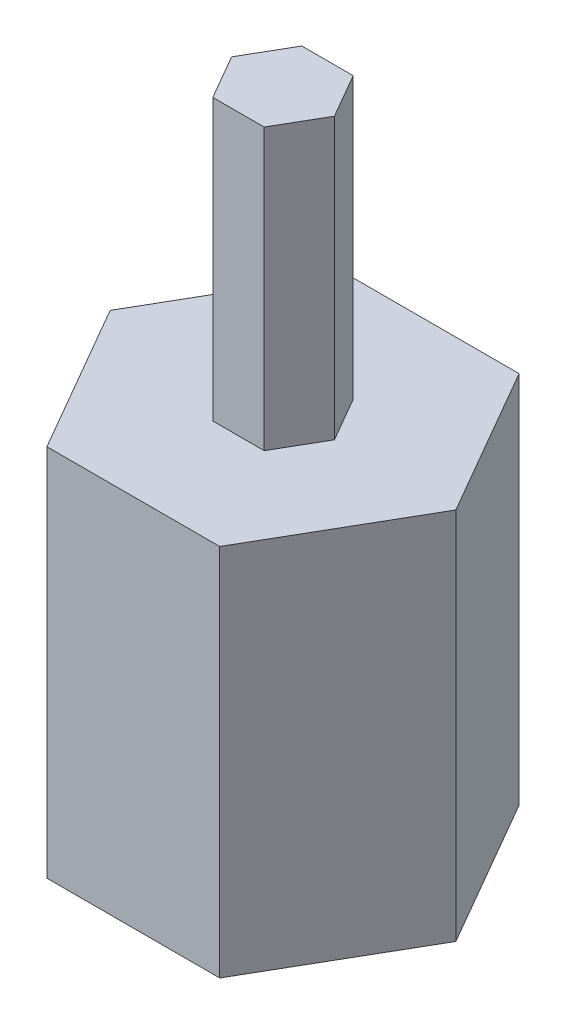
ISO-10303-21;
HEADER;
FILE_DESCRIPTION(('STEP AP214'),'2;1');
FILE_NAME('part.step','',(''),(''),'','','');
FILE_SCHEMA(('AUTOMOTIVE_DESIGN { 1 0 10303 214 1 1 1 1 }'));
ENDSEC;
DATA;
#1=APPLICATION_CONTEXT('core data for automotive mechanical design processes');
#2=APPLICATION_PROTOCOL_DEFINITION('international standard','automotive_design',2000,#1);
#3=PRODUCT_CONTEXT('',#1,'mechanical');
#4=PRODUCT('Part','Part','',(#3));
#5=PRODUCT_RELATED_PRODUCT_CATEGORY('part','',(#4));
#6=PRODUCT_DEFINITION_FORMATION('','',#4);
#7=PRODUCT_DEFINITION_CONTEXT('part definition',#1,'design');
#8=PRODUCT_DEFINITION('design','',#6,#7);
#9=PRODUCT_DEFINITION_SHAPE('','',#8);
#10=(LENGTH_UNIT() NAMED_UNIT(*) SI_UNIT(.MILLI.,.METRE.));
#11=(NAMED_UNIT(*) PLANE_ANGLE_UNIT() SI_UNIT($,.RADIAN.));
#12=(NAMED_UNIT(*) SI_UNIT($,.STERADIAN.) SOLID_ANGLE_UNIT());
#13=UNCERTAINTY_MEASURE_WITH_UNIT(LENGTH_MEASURE(1.E-05),#10,'distance_accuracy_value','');
#14=(GEOMETRIC_REPRESENTATION_CONTEXT(3) GLOBAL_UNCERTAINTY_ASSIGNED_CONTEXT((#13)) GLOBAL_UNIT_ASSIGNED_CONTEXT((#10,
#11,#12)) REPRESENTATION_CONTEXT('',''));
#15=CARTESIAN_POINT('',(0.,0.,0.));
#16=DIRECTION('',(0.,0.,1.));
#17=DIRECTION('',(1.,0.,0.));
#18=AXIS2_PLACEMENT_3D('',#15,#16,#17);
#19=CARTESIAN_POINT('',(0.549999999999999,6.,0.952627944162883));
#20=DIRECTION('',(-0.866025403784439,0.,-0.5));
#21=DIRECTION('',(-0.5,0.,0.866025403784439));
#22=AXIS2_PLACEMENT_3D('',#19,#20,#21);
#23=PLANE('',#22);
#24=DIRECTION('',(0.5,0.,-0.866025403784439));
#25=VECTOR('',#24,1.);
#26=CARTESIAN_POINT('',(0.549999999999999,0.,0.952627944162883));
#27=LINE('',#26,#25);
#28=CARTESIAN_POINT('',(0.549999999999999,0.,0.952627944162883));
#29=VERTEX_POINT('',#28);
#30=CARTESIAN_POINT('',(1.1,0.,0.));
#31=VERTEX_POINT('',#30);
#32=EDGE_CURVE('E145',#29,#31,#27,.T.);
#33=ORIENTED_EDGE('',*,*,#32,.T.);
#34=DIRECTION('',(0.,-1.,0.));
#35=VECTOR('',#34,1.);
#36=CARTESIAN_POINT('',(1.1,6.,0.));
#37=LINE('',#36,#35);
#38=CARTESIAN_POINT('',(1.1,6.,0.));
#39=VERTEX_POINT('',#38);
#40=EDGE_CURVE('E11',#39,#31,#37,.T.);
#41=ORIENTED_EDGE('',*,*,#40,.F.);
#42=DIRECTION('',(0.5,0.,-0.866025403784439));
#43=VECTOR('',#42,1.);
#44=CARTESIAN_POINT('',(0.549999999999999,6.,0.952627944162883));
#45=LINE('',#44,#43);
#46=CARTESIAN_POINT('',(0.549999999999999,6.,0.952627944162883));
#47=VERTEX_POINT('',#46);
#48=EDGE_CURVE('E154',#47,#39,#45,.T.);
#49=ORIENTED_EDGE('',*,*,#48,.F.);
#50=DIRECTION('',(0.,-1.,0.));
#51=VECTOR('',#50,1.);
#52=CARTESIAN_POINT('',(0.549999999999999,6.,0.952627944162883));
#53=LINE('',#52,#51);
#54=EDGE_CURVE('E165',#47,#29,#53,.T.);
#55=ORIENTED_EDGE('',*,*,#54,.T.);
#56=EDGE_LOOP('',(#33,#41,#49,#55));
#57=FACE_BOUND('',#56,.T.);
#58=ADVANCED_FACE('F36',(#57),#23,.F.);
#59=CARTESIAN_POINT('',(1.1,6.,0.));
#60=DIRECTION('',(-0.866025403784439,0.,0.5));
#61=DIRECTION('',(0.5,0.,0.866025403784439));
#62=AXIS2_PLACEMENT_3D('',#59,#60,#61);
#63=PLANE('',#62);
#64=DIRECTION('',(-0.5,0.,-0.866025403784439));
#65=VECTOR('',#64,1.);
#66=CARTESIAN_POINT('',(1.1,0.,0.));
#67=LINE('',#66,#65);
#68=CARTESIAN_POINT('',(0.55,0.,-0.952627944162883));
#69=VERTEX_POINT('',#68);
#70=EDGE_CURVE('E148',#31,#69,#67,.T.);
#71=ORIENTED_EDGE('',*,*,#70,.T.);
#72=DIRECTION('',(0.,-1.,0.));
#73=VECTOR('',#72,1.);
#74=CARTESIAN_POINT('',(0.55,6.,-0.952627944162883));
#75=LINE('',#74,#73);
#76=CARTESIAN_POINT('',(0.55,6.,-0.952627944162883));
#77=VERTEX_POINT('',#76);
#78=EDGE_CURVE('E44',#77,#69,#75,.T.);
#79=ORIENTED_EDGE('',*,*,#78,.F.);
#80=DIRECTION('',(-0.5,0.,-0.866025403784439));
#81=VECTOR('',#80,1.);
#82=CARTESIAN_POINT('',(1.1,6.,0.));
#83=LINE('',#82,#81);
#84=EDGE_CURVE('E156',#39,#77,#83,.T.);
#85=ORIENTED_EDGE('',*,*,#84,.F.);
#86=ORIENTED_EDGE('',*,*,#40,.T.);
#87=EDGE_LOOP('',(#71,#79,#85,#86));
#88=FACE_BOUND('',#87,.T.);
#89=ADVANCED_FACE('F198',(#88),#63,.F.);
#90=CARTESIAN_POINT('',(0.55,6.,-0.952627944162883));
#91=DIRECTION('',(0.,0.,1.));
#92=DIRECTION('',(1.,0.,0.));
#93=AXIS2_PLACEMENT_3D('',#90,#91,#92);
#94=PLANE('',#93);
#95=DIRECTION('',(-1.,0.,0.));
#96=VECTOR('',#95,1.);
#97=CARTESIAN_POINT('',(0.55,0.,-0.952627944162883));
#98=LINE('',#97,#96);
#99=CARTESIAN_POINT('',(-0.549999999999999,0.,-0.952627944162883));
#100=VERTEX_POINT('',#99);
#101=EDGE_CURVE('E169',#69,#100,#98,.T.);
#102=ORIENTED_EDGE('',*,*,#101,.T.);
#103=DIRECTION('',(0.,-1.,0.));
#104=VECTOR('',#103,1.);
#105=CARTESIAN_POINT('',(-0.549999999999999,6.,-0.952627944162883));
#106=LINE('',#105,#104);
#107=CARTESIAN_POINT('',(-0.549999999999999,6.,-0.952627944162883));
#108=VERTEX_POINT('',#107);
#109=EDGE_CURVE('E188',#108,#100,#106,.T.);
#110=ORIENTED_EDGE('',*,*,#109,.F.);
#111=DIRECTION('',(-1.,0.,0.));
#112=VECTOR('',#111,1.);
#113=CARTESIAN_POINT('',(0.55,6.,-0.952627944162883));
#114=LINE('',#113,#112);
#115=EDGE_CURVE('E159',#77,#108,#114,.T.);
#116=ORIENTED_EDGE('',*,*,#115,.F.);
#117=ORIENTED_EDGE('',*,*,#78,.T.);
#118=EDGE_LOOP('',(#102,#110,#116,#117));
#119=FACE_BOUND('',#118,.T.);
#120=ADVANCED_FACE('F194',(#119),#94,.F.);
#121=CARTESIAN_POINT('',(-0.549999999999999,6.,-0.952627944162883));
#122=DIRECTION('',(0.866025403784438,0.,0.5));
#123=DIRECTION('',(0.5,0.,-0.866025403784439));
#124=AXIS2_PLACEMENT_3D('',#121,#122,#123);
#125=PLANE('',#124);
#126=DIRECTION('',(-0.5,0.,0.866025403784439));
#127=VECTOR('',#126,1.);
#128=CARTESIAN_POINT('',(-0.549999999999999,0.,-0.952627944162883));
#129=LINE('',#128,#127);
#130=CARTESIAN_POINT('',(-1.1,0.,0.));
#131=VERTEX_POINT('',#130);
#132=EDGE_CURVE('E172',#100,#131,#129,.T.);
#133=ORIENTED_EDGE('',*,*,#132,.T.);
#134=DIRECTION('',(0.,-1.,0.));
#135=VECTOR('',#134,1.);
#136=CARTESIAN_POINT('',(-1.1,6.,0.));
#137=LINE('',#136,#135);
#138=CARTESIAN_POINT('',(-1.1,6.,0.));
#139=VERTEX_POINT('',#138);
#140=EDGE_CURVE('E185',#139,#131,#137,.T.);
#141=ORIENTED_EDGE('',*,*,#140,.F.);
#142=DIRECTION('',(-0.5,0.,0.866025403784439));
#143=VECTOR('',#142,1.);
#144=CARTESIAN_POINT('',(-0.549999999999999,6.,-0.952627944162883));
#145=LINE('',#144,#143);
#146=EDGE_CURVE('E161',#108,#139,#145,.T.);
#147=ORIENTED_EDGE('',*,*,#146,.F.);
#148=ORIENTED_EDGE('',*,*,#109,.T.);
#149=EDGE_LOOP('',(#133,#141,#147,#148));
#150=FACE_BOUND('',#149,.T.);
#151=ADVANCED_FACE('F205',(#150),#125,.F.);
#152=CARTESIAN_POINT('',(-1.1,6.,0.));
#153=DIRECTION('',(0.866025403784439,0.,-0.5));
#154=DIRECTION('',(-0.5,0.,-0.866025403784439));
#155=AXIS2_PLACEMENT_3D('',#152,#153,#154);
#156=PLANE('',#155);
#157=DIRECTION('',(0.5,0.,0.866025403784439));
#158=VECTOR('',#157,1.);
#159=CARTESIAN_POINT('',(-1.1,0.,0.));
#160=LINE('',#159,#158);
#161=CARTESIAN_POINT('',(-0.55,0.,0.952627944162882));
#162=VERTEX_POINT('',#161);
#163=EDGE_CURVE('E175',#131,#162,#160,.T.);
#164=ORIENTED_EDGE('',*,*,#163,.T.);
#165=DIRECTION('',(0.,-1.,0.));
#166=VECTOR('',#165,1.);
#167=CARTESIAN_POINT('',(-0.55,6.,0.952627944162882));
#168=LINE('',#167,#166);
#169=CARTESIAN_POINT('',(-0.55,6.,0.952627944162882));
#170=VERTEX_POINT('',#169);
#171=EDGE_CURVE('E182',#170,#162,#168,.T.);
#172=ORIENTED_EDGE('',*,*,#171,.F.);
#173=DIRECTION('',(0.5,0.,0.866025403784439));
#174=VECTOR('',#173,1.);
#175=CARTESIAN_POINT('',(-1.1,6.,0.));
#176=LINE('',#175,#174);
#177=EDGE_CURVE('E163',#139,#170,#176,.T.);
#178=ORIENTED_EDGE('',*,*,#177,.F.);
#179=ORIENTED_EDGE('',*,*,#140,.T.);
#180=EDGE_LOOP('',(#164,#172,#178,#179));
#181=FACE_BOUND('',#180,.T.);
#182=ADVANCED_FACE('F209',(#181),#156,.F.);
#183=CARTESIAN_POINT('',(-0.55,6.,0.952627944162882));
#184=DIRECTION('',(0.,0.,-1.));
#185=DIRECTION('',(-1.,0.,0.));
#186=AXIS2_PLACEMENT_3D('',#183,#184,#185);
#187=PLANE('',#186);
#188=DIRECTION('',(1.,0.,0.));
#189=VECTOR('',#188,1.);
#190=CARTESIAN_POINT('',(-0.55,0.,0.952627944162882));
#191=LINE('',#190,#189);
#192=EDGE_CURVE('E157',#162,#29,#191,.T.);
#193=ORIENTED_EDGE('',*,*,#192,.T.);
#194=ORIENTED_EDGE('',*,*,#54,.F.);
#195=DIRECTION('',(1.,0.,0.));
#196=VECTOR('',#195,1.);
#197=CARTESIAN_POINT('',(-0.55,6.,0.952627944162882));
#198=LINE('',#197,#196);
#199=EDGE_CURVE('E51',#170,#47,#198,.T.);
#200=ORIENTED_EDGE('',*,*,#199,.F.);
#201=ORIENTED_EDGE('',*,*,#171,.T.);
#202=EDGE_LOOP('',(#193,#194,#200,#201));
#203=FACE_BOUND('',#202,.T.);
#204=ADVANCED_FACE('F215',(#203),#187,.F.);
#205=CARTESIAN_POINT('',(0.,6.,0.));
#206=DIRECTION('',(0.,1.,0.));
#207=DIRECTION('',(0.,0.,1.));
#208=AXIS2_PLACEMENT_3D('',#205,#206,#207);
#209=PLANE('',#208);
#210=ORIENTED_EDGE('',*,*,#48,.T.);
#211=ORIENTED_EDGE('',*,*,#84,.T.);
#212=ORIENTED_EDGE('',*,*,#115,.T.);
#213=ORIENTED_EDGE('',*,*,#146,.T.);
#214=ORIENTED_EDGE('',*,*,#177,.T.);
#215=ORIENTED_EDGE('',*,*,#199,.T.);
#216=EDGE_LOOP('',(#210,#211,#212,#213,#214,#215));
#217=FACE_BOUND('',#216,.T.);
#218=ADVANCED_FACE('F211',(#217),#209,.T.);
#219=CARTESIAN_POINT('',(1.85,-8.,-3.20429399400242));
#220=DIRECTION('',(-0.866025403784439,0.,0.5));
#221=DIRECTION('',(0.5,0.,0.866025403784439));
#222=AXIS2_PLACEMENT_3D('',#219,#220,#221);
#223=PLANE('',#222);
#224=DIRECTION('',(0.5,0.,0.866025403784439));
#225=VECTOR('',#224,1.);
#226=CARTESIAN_POINT('',(1.85,0.,-3.20429399400242));
#227=LINE('',#226,#225);
#228=CARTESIAN_POINT('',(1.85,0.,-3.20429399400242));
#229=VERTEX_POINT('',#228);
#230=CARTESIAN_POINT('',(3.7,0.,0.));
#231=VERTEX_POINT('',#230);
#232=EDGE_CURVE('E144',#229,#231,#227,.T.);
#233=ORIENTED_EDGE('',*,*,#232,.T.);
#234=DIRECTION('',(0.,1.,0.));
#235=VECTOR('',#234,1.);
#236=CARTESIAN_POINT('',(3.7,-8.,0.));
#237=LINE('',#236,#235);
#238=CARTESIAN_POINT('',(3.7,-8.,0.));
#239=VERTEX_POINT('',#238);
#240=EDGE_CURVE('E124',#239,#231,#237,.T.);
#241=ORIENTED_EDGE('',*,*,#240,.F.);
#242=DIRECTION('',(0.5,0.,0.866025403784439));
#243=VECTOR('',#242,1.);
#244=CARTESIAN_POINT('',(1.85,-8.,-3.20429399400242));
#245=LINE('',#244,#243);
#246=CARTESIAN_POINT('',(1.85,-8.,-3.20429399400242));
#247=VERTEX_POINT('',#246);
#248=EDGE_CURVE('E131',#247,#239,#245,.T.);
#249=ORIENTED_EDGE('',*,*,#248,.F.);
#250=DIRECTION('',(0.,1.,0.));
#251=VECTOR('',#250,1.);
#252=CARTESIAN_POINT('',(1.85,-8.,-3.20429399400242));
#253=LINE('',#252,#251);
#254=EDGE_CURVE('E325',#247,#229,#253,.T.);
#255=ORIENTED_EDGE('',*,*,#254,.T.);
#256=EDGE_LOOP('',(#233,#241,#249,#255));
#257=FACE_BOUND('',#256,.T.);
#258=ADVANCED_FACE('F142',(#257),#223,.F.);
#259=CARTESIAN_POINT('',(3.7,-8.,0.));
#260=DIRECTION('',(-0.866025403784439,0.,-0.5));
#261=DIRECTION('',(-0.5,0.,0.866025403784439));
#262=AXIS2_PLACEMENT_3D('',#259,#260,#261);
#263=PLANE('',#262);
#264=DIRECTION('',(-0.5,0.,0.866025403784439));
#265=VECTOR('',#264,1.);
#266=CARTESIAN_POINT('',(3.7,0.,0.));
#267=LINE('',#266,#265);
#268=CARTESIAN_POINT('',(1.85,0.,3.20429399400242));
#269=VERTEX_POINT('',#268);
#270=EDGE_CURVE('E333',#231,#269,#267,.T.);
#271=ORIENTED_EDGE('',*,*,#270,.T.);
#272=DIRECTION('',(0.,1.,0.));
#273=VECTOR('',#272,1.);
#274=CARTESIAN_POINT('',(1.85,-8.,3.20429399400242));
#275=LINE('',#274,#273);
#276=CARTESIAN_POINT('',(1.85,-8.,3.20429399400242));
#277=VERTEX_POINT('',#276);
#278=EDGE_CURVE('E127',#277,#269,#275,.T.);
#279=ORIENTED_EDGE('',*,*,#278,.F.);
#280=DIRECTION('',(-0.5,0.,0.866025403784439));
#281=VECTOR('',#280,1.);
#282=CARTESIAN_POINT('',(3.7,-8.,0.));
#283=LINE('',#282,#281);
#284=EDGE_CURVE('E120',#239,#277,#283,.T.);
#285=ORIENTED_EDGE('',*,*,#284,.F.);
#286=ORIENTED_EDGE('',*,*,#240,.T.);
#287=EDGE_LOOP('',(#271,#279,#285,#286));
#288=FACE_BOUND('',#287,.T.);
#289=ADVANCED_FACE('F122',(#288),#263,.F.);
#290=CARTESIAN_POINT('',(1.85,-8.,3.20429399400242));
#291=DIRECTION('',(0.,0.,-1.));
#292=DIRECTION('',(-1.,0.,0.));
#293=AXIS2_PLACEMENT_3D('',#290,#291,#292);
#294=PLANE('',#293);
#295=DIRECTION('',(-1.,0.,0.));
#296=VECTOR('',#295,1.);
#297=CARTESIAN_POINT('',(1.85,0.,3.20429399400242));
#298=LINE('',#297,#296);
#299=CARTESIAN_POINT('',(-1.85,0.,3.20429399400242));
#300=VERTEX_POINT('',#299);
#301=EDGE_CURVE('E335',#269,#300,#298,.T.);
#302=ORIENTED_EDGE('',*,*,#301,.T.);
#303=DIRECTION('',(0.,1.,0.));
#304=VECTOR('',#303,1.);
#305=CARTESIAN_POINT('',(-1.85,-8.,3.20429399400242));
#306=LINE('',#305,#304);
#307=CARTESIAN_POINT('',(-1.85,-8.,3.20429399400242));
#308=VERTEX_POINT('',#307);
#309=EDGE_CURVE('E150',#308,#300,#306,.T.);
#310=ORIENTED_EDGE('',*,*,#309,.F.);
#311=DIRECTION('',(-1.,0.,0.));
#312=VECTOR('',#311,1.);
#313=CARTESIAN_POINT('',(1.85,-8.,3.20429399400242));
#314=LINE('',#313,#312);
#315=EDGE_CURVE('E130',#277,#308,#314,.T.);
#316=ORIENTED_EDGE('',*,*,#315,.F.);
#317=ORIENTED_EDGE('',*,*,#278,.T.);
#318=EDGE_LOOP('',(#302,#310,#316,#317));
#319=FACE_BOUND('',#318,.T.);
#320=ADVANCED_FACE('F264',(#319),#294,.F.);
#321=CARTESIAN_POINT('',(-1.85,-8.,3.20429399400242));
#322=DIRECTION('',(0.866025403784439,0.,-0.5));
#323=DIRECTION('',(-0.5,0.,-0.866025403784438));
#324=AXIS2_PLACEMENT_3D('',#321,#322,#323);
#325=PLANE('',#324);
#326=DIRECTION('',(-0.5,0.,-0.866025403784438));
#327=VECTOR('',#326,1.);
#328=CARTESIAN_POINT('',(-1.85,0.,3.20429399400242));
#329=LINE('',#328,#327);
#330=CARTESIAN_POINT('',(-3.7,0.,0.));
#331=VERTEX_POINT('',#330);
#332=EDGE_CURVE('E341',#300,#331,#329,.T.);
#333=ORIENTED_EDGE('',*,*,#332,.T.);
#334=DIRECTION('',(0.,1.,0.));
#335=VECTOR('',#334,1.);
#336=CARTESIAN_POINT('',(-3.7,-8.,0.));
#337=LINE('',#336,#335);
#338=CARTESIAN_POINT('',(-3.7,-8.,0.));
#339=VERTEX_POINT('',#338);
#340=EDGE_CURVE('E345',#339,#331,#337,.T.);
#341=ORIENTED_EDGE('',*,*,#340,.F.);
#342=DIRECTION('',(-0.5,0.,-0.866025403784438));
#343=VECTOR('',#342,1.);
#344=CARTESIAN_POINT('',(-1.85,-8.,3.20429399400242));
#345=LINE('',#344,#343);
#346=EDGE_CURVE('E352',#308,#339,#345,.T.);
#347=ORIENTED_EDGE('',*,*,#346,.F.);
#348=ORIENTED_EDGE('',*,*,#309,.T.);
#349=EDGE_LOOP('',(#333,#341,#347,#348));
#350=FACE_BOUND('',#349,.T.);
#351=ADVANCED_FACE('F273',(#350),#325,.F.);
#352=CARTESIAN_POINT('',(-3.7,-8.,0.));
#353=DIRECTION('',(0.866025403784439,0.,0.5));
#354=DIRECTION('',(0.5,0.,-0.866025403784439));
#355=AXIS2_PLACEMENT_3D('',#352,#353,#354);
#356=PLANE('',#355);
#357=DIRECTION('',(0.5,0.,-0.866025403784439));
#358=VECTOR('',#357,1.);
#359=CARTESIAN_POINT('',(-3.7,0.,0.));
#360=LINE('',#359,#358);
#361=CARTESIAN_POINT('',(-1.85,0.,-3.20429399400242));
#362=VERTEX_POINT('',#361);
#363=EDGE_CURVE('E329',#331,#362,#360,.T.);
#364=ORIENTED_EDGE('',*,*,#363,.T.);
#365=DIRECTION('',(0.,1.,0.));
#366=VECTOR('',#365,1.);
#367=CARTESIAN_POINT('',(-1.85,-8.,-3.20429399400242));
#368=LINE('',#367,#366);
#369=CARTESIAN_POINT('',(-1.85,-8.,-3.20429399400242));
#370=VERTEX_POINT('',#369);
#371=EDGE_CURVE('E327',#370,#362,#368,.T.);
#372=ORIENTED_EDGE('',*,*,#371,.F.);
#373=DIRECTION('',(0.5,0.,-0.866025403784439));
#374=VECTOR('',#373,1.);
#375=CARTESIAN_POINT('',(-3.7,-8.,0.));
#376=LINE('',#375,#374);
#377=EDGE_CURVE('E354',#339,#370,#376,.T.);
#378=ORIENTED_EDGE('',*,*,#377,.F.);
#379=ORIENTED_EDGE('',*,*,#340,.T.);
#380=EDGE_LOOP('',(#364,#372,#378,#379));
#381=FACE_BOUND('',#380,.T.);
#382=ADVANCED_FACE('F283',(#381),#356,.F.);
#383=CARTESIAN_POINT('',(-1.85,-8.,-3.20429399400242));
#384=DIRECTION('',(0.,0.,1.));
#385=DIRECTION('',(1.,0.,0.));
#386=AXIS2_PLACEMENT_3D('',#383,#384,#385);
#387=PLANE('',#386);
#388=DIRECTION('',(1.,0.,0.));
#389=VECTOR('',#388,1.);
#390=CARTESIAN_POINT('',(-1.85,0.,-3.20429399400242));
#391=LINE('',#390,#389);
#392=EDGE_CURVE('E140',#362,#229,#391,.T.);
#393=ORIENTED_EDGE('',*,*,#392,.T.);
#394=ORIENTED_EDGE('',*,*,#254,.F.);
#395=DIRECTION('',(1.,0.,0.));
#396=VECTOR('',#395,1.);
#397=CARTESIAN_POINT('',(-1.85,-8.,-3.20429399400242));
#398=LINE('',#397,#396);
#399=EDGE_CURVE('E136',#370,#247,#398,.T.);
#400=ORIENTED_EDGE('',*,*,#399,.F.);
#401=ORIENTED_EDGE('',*,*,#371,.T.);
#402=EDGE_LOOP('',(#393,#394,#400,#401));
#403=FACE_BOUND('',#402,.T.);
#404=ADVANCED_FACE('F293',(#403),#387,.F.);
#405=CARTESIAN_POINT('',(0.,-8.,0.));
#406=DIRECTION('',(0.,-1.,0.));
#407=DIRECTION('',(0.,0.,-1.));
#408=AXIS2_PLACEMENT_3D('',#405,#406,#407);
#409=PLANE('',#408);
#410=ORIENTED_EDGE('',*,*,#248,.T.);
#411=ORIENTED_EDGE('',*,*,#284,.T.);
#412=ORIENTED_EDGE('',*,*,#315,.T.);
#413=ORIENTED_EDGE('',*,*,#346,.T.);
#414=ORIENTED_EDGE('',*,*,#377,.T.);
#415=ORIENTED_EDGE('',*,*,#399,.T.);
#416=EDGE_LOOP('',(#410,#411,#412,#413,#414,#415));
#417=FACE_BOUND('',#416,.T.);
#418=ADVANCED_FACE('F134',(#417),#409,.T.);
#419=CARTESIAN_POINT('',(0.,0.,0.));
#420=DIRECTION('',(0.,-1.,0.));
#421=DIRECTION('',(0.,0.,-1.));
#422=AXIS2_PLACEMENT_3D('',#419,#420,#421);
#423=PLANE('',#422);
#424=ORIENTED_EDGE('',*,*,#32,.F.);
#425=ORIENTED_EDGE('',*,*,#192,.F.);
#426=ORIENTED_EDGE('',*,*,#163,.F.);
#427=ORIENTED_EDGE('',*,*,#132,.F.);
#428=ORIENTED_EDGE('',*,*,#101,.F.);
#429=ORIENTED_EDGE('',*,*,#70,.F.);
#430=EDGE_LOOP('',(#424,#425,#426,#427,#428,#429));
#431=FACE_BOUND('',#430,.T.);
#432=ORIENTED_EDGE('',*,*,#232,.F.);
#433=ORIENTED_EDGE('',*,*,#392,.F.);
#434=ORIENTED_EDGE('',*,*,#363,.F.);
#435=ORIENTED_EDGE('',*,*,#332,.F.);
#436=ORIENTED_EDGE('',*,*,#301,.F.);
#437=ORIENTED_EDGE('',*,*,#270,.F.);
#438=EDGE_LOOP('',(#432,#433,#434,#435,#436,#437));
#439=FACE_BOUND('',#438,.T.);
#440=ADVANCED_FACE('F201',(#431,#439),#423,.F.);
#441=CLOSED_SHELL('',(#58,#89,#120,#151,#182,#204,#218,#258,#289,#320,#351,#382,#404,#418,#440));
#442=MANIFOLD_SOLID_BREP('B2',#441);
#443=ADVANCED_BREP_SHAPE_REPRESENTATION('',(#18,#442),#14);
#444=SHAPE_DEFINITION_REPRESENTATION(#9,#443);
ENDSEC;
END-ISO-10303-21;
